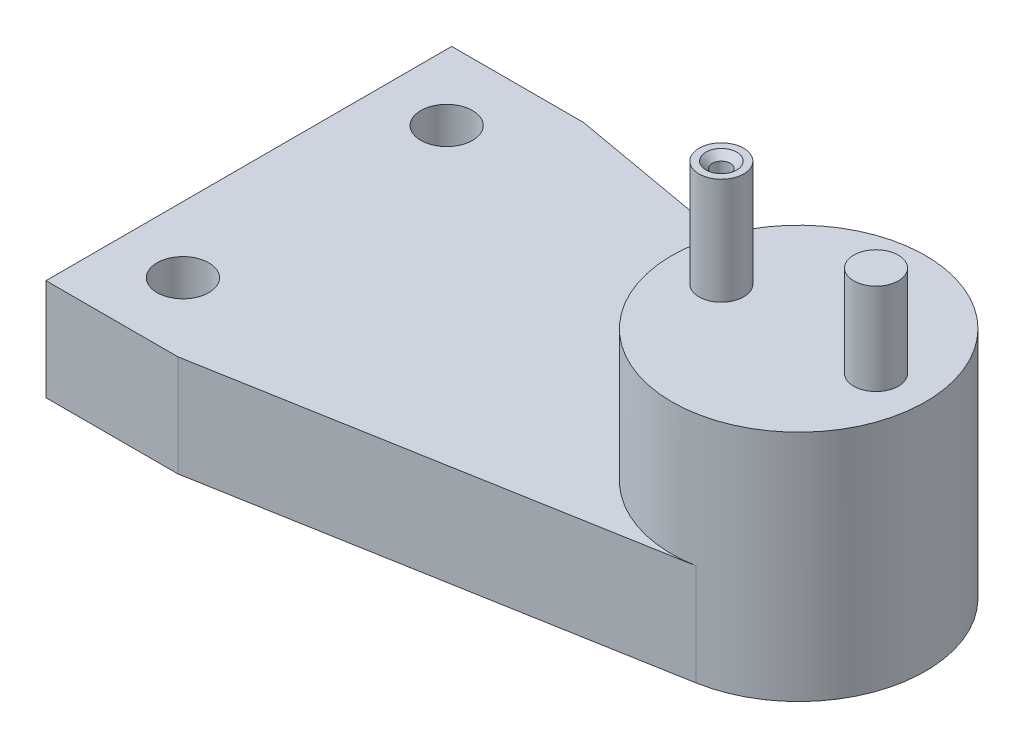
ISO-10303-21;
HEADER;
FILE_DESCRIPTION(('STEP AP214'),'2;1');
FILE_NAME('part.step','',(''),(''),'','','');
FILE_SCHEMA(('AUTOMOTIVE_DESIGN { 1 0 10303 214 1 1 1 1 }'));
ENDSEC;
DATA;
#1=APPLICATION_CONTEXT('core data for automotive mechanical design processes');
#2=APPLICATION_PROTOCOL_DEFINITION('international standard','automotive_design',2000,#1);
#3=PRODUCT_CONTEXT('',#1,'mechanical');
#4=PRODUCT('Part','Part','',(#3));
#5=PRODUCT_RELATED_PRODUCT_CATEGORY('part','',(#4));
#6=PRODUCT_DEFINITION_FORMATION('','',#4);
#7=PRODUCT_DEFINITION_CONTEXT('part definition',#1,'design');
#8=PRODUCT_DEFINITION('design','',#6,#7);
#9=PRODUCT_DEFINITION_SHAPE('','',#8);
#10=(LENGTH_UNIT() NAMED_UNIT(*) SI_UNIT(.MILLI.,.METRE.));
#11=(NAMED_UNIT(*) PLANE_ANGLE_UNIT() SI_UNIT($,.RADIAN.));
#12=(NAMED_UNIT(*) SI_UNIT($,.STERADIAN.) SOLID_ANGLE_UNIT());
#13=UNCERTAINTY_MEASURE_WITH_UNIT(LENGTH_MEASURE(1.E-05),#10,'distance_accuracy_value','');
#14=(GEOMETRIC_REPRESENTATION_CONTEXT(3) GLOBAL_UNCERTAINTY_ASSIGNED_CONTEXT((#13)) GLOBAL_UNIT_ASSIGNED_CONTEXT((#10,
#11,#12)) REPRESENTATION_CONTEXT('',''));
#15=CARTESIAN_POINT('',(0.,0.,0.));
#16=DIRECTION('',(0.,0.,1.));
#17=DIRECTION('',(1.,0.,0.));
#18=AXIS2_PLACEMENT_3D('',#15,#16,#17);
#19=CARTESIAN_POINT('',(54.205,23.,0.));
#20=DIRECTION('',(0.,1.,0.));
#21=DIRECTION('',(0.,0.,1.));
#22=AXIS2_PLACEMENT_3D('',#19,#20,#21);
#23=PLANE('',#22);
#24=CARTESIAN_POINT('',(61.83,23.,0.));
#25=DIRECTION('',(0.,1.,0.));
#26=DIRECTION('',(0.,0.,1.));
#27=AXIS2_PLACEMENT_3D('',#24,#25,#26);
#28=CIRCLE('',#27,2.2);
#29=CARTESIAN_POINT('',(61.83,23.,2.2));
#30=VERTEX_POINT('',#29);
#31=EDGE_CURVE('E132',#30,#30,#28,.T.);
#32=ORIENTED_EDGE('',*,*,#31,.F.);
#33=EDGE_LOOP('',(#32));
#34=FACE_BOUND('',#33,.T.);
#35=CARTESIAN_POINT('',(54.205,23.,0.));
#36=DIRECTION('',(0.,1.,0.));
#37=DIRECTION('',(0.,0.,1.));
#38=AXIS2_PLACEMENT_3D('',#35,#36,#37);
#39=CIRCLE('',#38,12.5);
#40=CARTESIAN_POINT('',(54.205,23.,12.5));
#41=VERTEX_POINT('',#40);
#42=EDGE_CURVE('E150',#41,#41,#39,.T.);
#43=ORIENTED_EDGE('',*,*,#42,.T.);
#44=EDGE_LOOP('',(#43));
#45=FACE_BOUND('',#44,.T.);
#46=CARTESIAN_POINT('',(46.58,23.,0.));
#47=DIRECTION('',(0.,1.,0.));
#48=DIRECTION('',(0.,0.,1.));
#49=AXIS2_PLACEMENT_3D('',#46,#47,#48);
#50=CIRCLE('',#49,2.2);
#51=CARTESIAN_POINT('',(46.58,23.,2.2));
#52=VERTEX_POINT('',#51);
#53=EDGE_CURVE('E123',#52,#52,#50,.T.);
#54=ORIENTED_EDGE('',*,*,#53,.F.);
#55=EDGE_LOOP('',(#54));
#56=FACE_BOUND('',#55,.T.);
#57=ADVANCED_FACE('F45',(#34,#45,#56),#23,.T.);
#58=CARTESIAN_POINT('',(54.205,10.,0.));
#59=DIRECTION('',(0.,-1.,0.));
#60=DIRECTION('',(0.,0.,-1.));
#61=AXIS2_PLACEMENT_3D('',#58,#59,#60);
#62=CYLINDRICAL_SURFACE('',#61,12.5);
#63=CARTESIAN_POINT('',(54.205,0.,0.));
#64=DIRECTION('',(0.,1.,0.));
#65=DIRECTION('',(0.,0.,1.));
#66=AXIS2_PLACEMENT_3D('',#63,#64,#65);
#67=CIRCLE('',#66,12.5);
#68=CARTESIAN_POINT('',(56.3870519478952,0.,12.3080725256511));
#69=VERTEX_POINT('',#68);
#70=CARTESIAN_POINT('',(56.3870519478952,0.,-12.3080725256511));
#71=VERTEX_POINT('',#70);
#72=EDGE_CURVE('E175',#69,#71,#67,.T.);
#73=ORIENTED_EDGE('',*,*,#72,.T.);
#74=DIRECTION('',(0.,-1.,0.));
#75=VECTOR('',#74,1.);
#76=CARTESIAN_POINT('',(56.3870519478952,10.,-12.3080725256511));
#77=LINE('',#76,#75);
#78=CARTESIAN_POINT('',(56.3870519478952,10.,-12.3080725256511));
#79=VERTEX_POINT('',#78);
#80=EDGE_CURVE('E55',#79,#71,#77,.T.);
#81=ORIENTED_EDGE('',*,*,#80,.F.);
#82=CARTESIAN_POINT('',(54.205,10.,0.));
#83=DIRECTION('',(0.,1.,0.));
#84=DIRECTION('',(0.,0.,1.));
#85=AXIS2_PLACEMENT_3D('',#82,#83,#84);
#86=CIRCLE('',#85,12.5);
#87=CARTESIAN_POINT('',(56.3870519478952,10.,12.3080725256511));
#88=VERTEX_POINT('',#87);
#89=EDGE_CURVE('E11',#79,#88,#86,.T.);
#90=ORIENTED_EDGE('',*,*,#89,.T.);
#91=DIRECTION('',(0.,-1.,0.));
#92=VECTOR('',#91,1.);
#93=CARTESIAN_POINT('',(56.3870519478952,10.,12.3080725256511));
#94=LINE('',#93,#92);
#95=EDGE_CURVE('E169',#88,#69,#94,.T.);
#96=ORIENTED_EDGE('',*,*,#95,.T.);
#97=EDGE_LOOP('',(#73,#81,#90,#96));
#98=FACE_BOUND('',#97,.T.);
#99=ORIENTED_EDGE('',*,*,#42,.F.);
#100=EDGE_LOOP('',(#99));
#101=FACE_BOUND('',#100,.T.);
#102=ADVANCED_FACE('F47',(#98,#101),#62,.T.);
#103=CARTESIAN_POINT('',(13.,10.,-20.));
#104=DIRECTION('',(-0.174564155831615,0.,0.984645802052086));
#105=DIRECTION('',(0.984645802052086,0.,0.174564155831615));
#106=AXIS2_PLACEMENT_3D('',#103,#104,#105);
#107=PLANE('',#106);
#108=DIRECTION('',(-0.984645802052086,0.,-0.174564155831615));
#109=VECTOR('',#108,1.);
#110=CARTESIAN_POINT('',(13.,0.,-20.));
#111=LINE('',#110,#109);
#112=CARTESIAN_POINT('',(13.,0.,-20.));
#113=VERTEX_POINT('',#112);
#114=EDGE_CURVE('E79',#71,#113,#111,.T.);
#115=ORIENTED_EDGE('',*,*,#114,.T.);
#116=DIRECTION('',(0.,-1.,0.));
#117=VECTOR('',#116,1.);
#118=CARTESIAN_POINT('',(13.,10.,-20.));
#119=LINE('',#118,#117);
#120=CARTESIAN_POINT('',(13.,10.,-20.));
#121=VERTEX_POINT('',#120);
#122=EDGE_CURVE('E182',#121,#113,#119,.T.);
#123=ORIENTED_EDGE('',*,*,#122,.F.);
#124=DIRECTION('',(-0.984645802052086,0.,-0.174564155831615));
#125=VECTOR('',#124,1.);
#126=CARTESIAN_POINT('',(13.,10.,-20.));
#127=LINE('',#126,#125);
#128=EDGE_CURVE('E172',#79,#121,#127,.T.);
#129=ORIENTED_EDGE('',*,*,#128,.F.);
#130=ORIENTED_EDGE('',*,*,#80,.T.);
#131=EDGE_LOOP('',(#115,#123,#129,#130));
#132=FACE_BOUND('',#131,.T.);
#133=ADVANCED_FACE('F195',(#132),#107,.F.);
#134=CARTESIAN_POINT('',(0.,10.,-20.));
#135=DIRECTION('',(0.,0.,1.));
#136=DIRECTION('',(1.,0.,0.));
#137=AXIS2_PLACEMENT_3D('',#134,#135,#136);
#138=PLANE('',#137);
#139=DIRECTION('',(-1.,0.,0.));
#140=VECTOR('',#139,1.);
#141=CARTESIAN_POINT('',(0.,0.,-20.));
#142=LINE('',#141,#140);
#143=CARTESIAN_POINT('',(0.,0.,-20.));
#144=VERTEX_POINT('',#143);
#145=EDGE_CURVE('E84',#113,#144,#142,.T.);
#146=ORIENTED_EDGE('',*,*,#145,.T.);
#147=DIRECTION('',(0.,-1.,0.));
#148=VECTOR('',#147,1.);
#149=CARTESIAN_POINT('',(0.,10.,-20.));
#150=LINE('',#149,#148);
#151=CARTESIAN_POINT('',(0.,10.,-20.));
#152=VERTEX_POINT('',#151);
#153=EDGE_CURVE('E174',#152,#144,#150,.T.);
#154=ORIENTED_EDGE('',*,*,#153,.F.);
#155=DIRECTION('',(-1.,0.,0.));
#156=VECTOR('',#155,1.);
#157=CARTESIAN_POINT('',(0.,10.,-20.));
#158=LINE('',#157,#156);
#159=EDGE_CURVE('E64',#121,#152,#158,.T.);
#160=ORIENTED_EDGE('',*,*,#159,.F.);
#161=ORIENTED_EDGE('',*,*,#122,.T.);
#162=EDGE_LOOP('',(#146,#154,#160,#161));
#163=FACE_BOUND('',#162,.T.);
#164=ADVANCED_FACE('F196',(#163),#138,.F.);
#165=CARTESIAN_POINT('',(0.,10.,0.));
#166=DIRECTION('',(1.,0.,0.));
#167=DIRECTION('',(0.,0.,-1.));
#168=AXIS2_PLACEMENT_3D('',#165,#166,#167);
#169=PLANE('',#168);
#170=DIRECTION('',(0.,0.,1.));
#171=VECTOR('',#170,1.);
#172=CARTESIAN_POINT('',(0.,0.,0.));
#173=LINE('',#172,#171);
#174=CARTESIAN_POINT('',(0.,0.,20.));
#175=VERTEX_POINT('',#174);
#176=EDGE_CURVE('E179',#144,#175,#173,.T.);
#177=ORIENTED_EDGE('',*,*,#176,.T.);
#178=DIRECTION('',(0.,-1.,0.));
#179=VECTOR('',#178,1.);
#180=CARTESIAN_POINT('',(0.,10.,20.));
#181=LINE('',#180,#179);
#182=CARTESIAN_POINT('',(0.,10.,20.));
#183=VERTEX_POINT('',#182);
#184=EDGE_CURVE('E157',#183,#175,#181,.T.);
#185=ORIENTED_EDGE('',*,*,#184,.F.);
#186=DIRECTION('',(0.,0.,1.));
#187=VECTOR('',#186,1.);
#188=CARTESIAN_POINT('',(0.,10.,0.));
#189=LINE('',#188,#187);
#190=EDGE_CURVE('E171',#152,#183,#189,.T.);
#191=ORIENTED_EDGE('',*,*,#190,.F.);
#192=ORIENTED_EDGE('',*,*,#153,.T.);
#193=EDGE_LOOP('',(#177,#185,#191,#192));
#194=FACE_BOUND('',#193,.T.);
#195=ADVANCED_FACE('F201',(#194),#169,.F.);
#196=CARTESIAN_POINT('',(54.205,10.,0.));
#197=DIRECTION('',(0.,1.,0.));
#198=DIRECTION('',(0.,0.,1.));
#199=AXIS2_PLACEMENT_3D('',#196,#197,#198);
#200=PLANE('',#199);
#201=CARTESIAN_POINT('',(6.5,10.,-13.));
#202=DIRECTION('',(0.,1.,0.));
#203=DIRECTION('',(0.,0.,1.));
#204=AXIS2_PLACEMENT_3D('',#201,#202,#203);
#205=CIRCLE('',#204,2.55269999999999);
#206=CARTESIAN_POINT('',(6.5,10.,-10.4473));
#207=VERTEX_POINT('',#206);
#208=EDGE_CURVE('E136',#207,#207,#205,.T.);
#209=ORIENTED_EDGE('',*,*,#208,.F.);
#210=EDGE_LOOP('',(#209));
#211=FACE_BOUND('',#210,.T.);
#212=CARTESIAN_POINT('',(6.5,10.,13.));
#213=DIRECTION('',(0.,1.,0.));
#214=DIRECTION('',(0.,0.,1.));
#215=AXIS2_PLACEMENT_3D('',#212,#213,#214);
#216=CIRCLE('',#215,2.55269999999999);
#217=CARTESIAN_POINT('',(6.5,10.,15.5527));
#218=VERTEX_POINT('',#217);
#219=EDGE_CURVE('E144',#218,#218,#216,.T.);
#220=ORIENTED_EDGE('',*,*,#219,.F.);
#221=EDGE_LOOP('',(#220));
#222=FACE_BOUND('',#221,.T.);
#223=ORIENTED_EDGE('',*,*,#89,.F.);
#224=ORIENTED_EDGE('',*,*,#128,.T.);
#225=ORIENTED_EDGE('',*,*,#159,.T.);
#226=ORIENTED_EDGE('',*,*,#190,.T.);
#227=DIRECTION('',(-1.,0.,0.));
#228=VECTOR('',#227,1.);
#229=CARTESIAN_POINT('',(0.,10.,20.));
#230=LINE('',#229,#228);
#231=CARTESIAN_POINT('',(13.,10.,20.));
#232=VERTEX_POINT('',#231);
#233=EDGE_CURVE('E154',#232,#183,#230,.T.);
#234=ORIENTED_EDGE('',*,*,#233,.F.);
#235=DIRECTION('',(-0.984645802052086,0.,0.174564155831615));
#236=VECTOR('',#235,1.);
#237=CARTESIAN_POINT('',(13.,10.,20.));
#238=LINE('',#237,#236);
#239=EDGE_CURVE('E158',#88,#232,#238,.T.);
#240=ORIENTED_EDGE('',*,*,#239,.F.);
#241=EDGE_LOOP('',(#223,#224,#225,#226,#234,#240));
#242=FACE_BOUND('',#241,.T.);
#243=ADVANCED_FACE('F194',(#211,#222,#242),#200,.T.);
#244=CARTESIAN_POINT('',(54.205,0.,0.));
#245=DIRECTION('',(0.,1.,0.));
#246=DIRECTION('',(0.,0.,1.));
#247=AXIS2_PLACEMENT_3D('',#244,#245,#246);
#248=PLANE('',#247);
#249=CARTESIAN_POINT('',(6.5,0.,-13.));
#250=DIRECTION('',(0.,1.,0.));
#251=DIRECTION('',(0.,0.,1.));
#252=AXIS2_PLACEMENT_3D('',#249,#250,#251);
#253=CIRCLE('',#252,2.55269999999998);
#254=CARTESIAN_POINT('',(6.5,0.,-10.4473));
#255=VERTEX_POINT('',#254);
#256=EDGE_CURVE('E141',#255,#255,#253,.T.);
#257=ORIENTED_EDGE('',*,*,#256,.T.);
#258=EDGE_LOOP('',(#257));
#259=FACE_BOUND('',#258,.T.);
#260=CARTESIAN_POINT('',(6.5,0.,13.));
#261=DIRECTION('',(0.,1.,0.));
#262=DIRECTION('',(0.,0.,1.));
#263=AXIS2_PLACEMENT_3D('',#260,#261,#262);
#264=CIRCLE('',#263,2.55269999999998);
#265=CARTESIAN_POINT('',(6.5,0.,15.5527));
#266=VERTEX_POINT('',#265);
#267=EDGE_CURVE('E147',#266,#266,#264,.T.);
#268=ORIENTED_EDGE('',*,*,#267,.T.);
#269=EDGE_LOOP('',(#268));
#270=FACE_BOUND('',#269,.T.);
#271=ORIENTED_EDGE('',*,*,#72,.F.);
#272=DIRECTION('',(-0.984645802052086,0.,0.174564155831615));
#273=VECTOR('',#272,1.);
#274=CARTESIAN_POINT('',(13.,0.,20.));
#275=LINE('',#274,#273);
#276=CARTESIAN_POINT('',(13.,0.,20.));
#277=VERTEX_POINT('',#276);
#278=EDGE_CURVE('E153',#69,#277,#275,.T.);
#279=ORIENTED_EDGE('',*,*,#278,.T.);
#280=DIRECTION('',(-1.,0.,0.));
#281=VECTOR('',#280,1.);
#282=CARTESIAN_POINT('',(0.,0.,20.));
#283=LINE('',#282,#281);
#284=EDGE_CURVE('E161',#277,#175,#283,.T.);
#285=ORIENTED_EDGE('',*,*,#284,.T.);
#286=ORIENTED_EDGE('',*,*,#176,.F.);
#287=ORIENTED_EDGE('',*,*,#145,.F.);
#288=ORIENTED_EDGE('',*,*,#114,.F.);
#289=EDGE_LOOP('',(#271,#279,#285,#286,#287,#288));
#290=FACE_BOUND('',#289,.T.);
#291=ADVANCED_FACE('F214',(#259,#270,#290),#248,.F.);
#292=CARTESIAN_POINT('',(13.,10.,20.));
#293=DIRECTION('',(-0.174564155831615,0.,-0.984645802052086));
#294=DIRECTION('',(0.984645802052086,0.,-0.174564155831615));
#295=AXIS2_PLACEMENT_3D('',#292,#293,#294);
#296=PLANE('',#295);
#297=ORIENTED_EDGE('',*,*,#278,.F.);
#298=ORIENTED_EDGE('',*,*,#95,.F.);
#299=ORIENTED_EDGE('',*,*,#239,.T.);
#300=DIRECTION('',(0.,-1.,0.));
#301=VECTOR('',#300,1.);
#302=CARTESIAN_POINT('',(13.,10.,20.));
#303=LINE('',#302,#301);
#304=EDGE_CURVE('E166',#232,#277,#303,.T.);
#305=ORIENTED_EDGE('',*,*,#304,.T.);
#306=EDGE_LOOP('',(#297,#298,#299,#305));
#307=FACE_BOUND('',#306,.T.);
#308=ADVANCED_FACE('F208',(#307),#296,.F.);
#309=CARTESIAN_POINT('',(0.,10.,20.));
#310=DIRECTION('',(0.,0.,-1.));
#311=DIRECTION('',(1.,0.,0.));
#312=AXIS2_PLACEMENT_3D('',#309,#310,#311);
#313=PLANE('',#312);
#314=ORIENTED_EDGE('',*,*,#284,.F.);
#315=ORIENTED_EDGE('',*,*,#304,.F.);
#316=ORIENTED_EDGE('',*,*,#233,.T.);
#317=ORIENTED_EDGE('',*,*,#184,.T.);
#318=EDGE_LOOP('',(#314,#315,#316,#317));
#319=FACE_BOUND('',#318,.T.);
#320=ADVANCED_FACE('F205',(#319),#313,.F.);
#321=CARTESIAN_POINT('',(6.5,10.,13.));
#322=DIRECTION('',(0.,1.,0.));
#323=DIRECTION('',(0.,0.,1.));
#324=AXIS2_PLACEMENT_3D('',#321,#322,#323);
#325=CYLINDRICAL_SURFACE('',#324,2.55269999999998);
#326=ORIENTED_EDGE('',*,*,#219,.T.);
#327=EDGE_LOOP('',(#326));
#328=FACE_BOUND('',#327,.T.);
#329=ORIENTED_EDGE('',*,*,#267,.F.);
#330=EDGE_LOOP('',(#329));
#331=FACE_BOUND('',#330,.T.);
#332=ADVANCED_FACE('F237',(#328,#331),#325,.F.);
#333=CARTESIAN_POINT('',(6.5,10.,-13.));
#334=DIRECTION('',(0.,1.,0.));
#335=DIRECTION('',(0.,0.,1.));
#336=AXIS2_PLACEMENT_3D('',#333,#334,#335);
#337=CYLINDRICAL_SURFACE('',#336,2.55269999999998);
#338=ORIENTED_EDGE('',*,*,#208,.T.);
#339=EDGE_LOOP('',(#338));
#340=FACE_BOUND('',#339,.T.);
#341=ORIENTED_EDGE('',*,*,#256,.F.);
#342=EDGE_LOOP('',(#341));
#343=FACE_BOUND('',#342,.T.);
#344=ADVANCED_FACE('F243',(#340,#343),#337,.F.);
#345=CARTESIAN_POINT('',(61.83,32.,0.));
#346=DIRECTION('',(0.,-1.,0.));
#347=DIRECTION('',(0.,0.,-1.));
#348=AXIS2_PLACEMENT_3D('',#345,#346,#347);
#349=CYLINDRICAL_SURFACE('',#348,2.2);
#350=CARTESIAN_POINT('',(61.83,32.,0.));
#351=DIRECTION('',(0.,1.,0.));
#352=DIRECTION('',(0.,0.,1.));
#353=AXIS2_PLACEMENT_3D('',#350,#351,#352);
#354=CIRCLE('',#353,2.2);
#355=CARTESIAN_POINT('',(61.83,32.,2.2));
#356=VERTEX_POINT('',#355);
#357=EDGE_CURVE('E133',#356,#356,#354,.T.);
#358=ORIENTED_EDGE('',*,*,#357,.F.);
#359=EDGE_LOOP('',(#358));
#360=FACE_BOUND('',#359,.T.);
#361=ORIENTED_EDGE('',*,*,#31,.T.);
#362=EDGE_LOOP('',(#361));
#363=FACE_BOUND('',#362,.T.);
#364=ADVANCED_FACE('F248',(#360,#363),#349,.T.);
#365=CARTESIAN_POINT('',(61.83,32.,0.));
#366=DIRECTION('',(0.,1.,0.));
#367=DIRECTION('',(0.,0.,1.));
#368=AXIS2_PLACEMENT_3D('',#365,#366,#367);
#369=PLANE('',#368);
#370=ORIENTED_EDGE('',*,*,#357,.T.);
#371=EDGE_LOOP('',(#370));
#372=FACE_BOUND('',#371,.T.);
#373=ADVANCED_FACE('F257',(#372),#369,.T.);
#374=CARTESIAN_POINT('',(46.58,32.,0.));
#375=DIRECTION('',(0.,-1.,0.));
#376=DIRECTION('',(0.,0.,-1.));
#377=AXIS2_PLACEMENT_3D('',#374,#375,#376);
#378=CYLINDRICAL_SURFACE('',#377,2.2);
#379=ORIENTED_EDGE('',*,*,#53,.T.);
#380=EDGE_LOOP('',(#379));
#381=FACE_BOUND('',#380,.T.);
#382=CARTESIAN_POINT('',(46.58,33.5,0.));
#383=DIRECTION('',(0.,1.,0.));
#384=DIRECTION('',(0.,0.,1.));
#385=AXIS2_PLACEMENT_3D('',#382,#383,#384);
#386=CIRCLE('',#385,2.2);
#387=CARTESIAN_POINT('',(46.58,33.5,2.2));
#388=VERTEX_POINT('',#387);
#389=EDGE_CURVE('E119',#388,#388,#386,.T.);
#390=ORIENTED_EDGE('',*,*,#389,.F.);
#391=EDGE_LOOP('',(#390));
#392=FACE_BOUND('',#391,.T.);
#393=ADVANCED_FACE('F264',(#381,#392),#378,.T.);
#394=CARTESIAN_POINT('',(46.58,33.5,0.));
#395=DIRECTION('',(0.,1.,0.));
#396=DIRECTION('',(0.,0.,1.));
#397=AXIS2_PLACEMENT_3D('',#394,#395,#396);
#398=PLANE('',#397);
#399=CARTESIAN_POINT('',(46.58,33.5,0.));
#400=DIRECTION('',(0.,1.,0.));
#401=DIRECTION('',(0.,0.,1.));
#402=AXIS2_PLACEMENT_3D('',#399,#400,#401);
#403=CIRCLE('',#402,1.524);
#404=CARTESIAN_POINT('',(46.58,33.5,1.524));
#405=VERTEX_POINT('',#404);
#406=EDGE_CURVE('E126',#405,#405,#403,.T.);
#407=ORIENTED_EDGE('',*,*,#406,.F.);
#408=EDGE_LOOP('',(#407));
#409=FACE_BOUND('',#408,.T.);
#410=ORIENTED_EDGE('',*,*,#389,.T.);
#411=EDGE_LOOP('',(#410));
#412=FACE_BOUND('',#411,.T.);
#413=ADVANCED_FACE('F113',(#409,#412),#398,.T.);
#414=CARTESIAN_POINT('',(46.58,26.86,0.));
#415=DIRECTION('',(0.,1.,0.));
#416=DIRECTION('',(0.,0.,1.));
#417=AXIS2_PLACEMENT_3D('',#414,#415,#416);
#418=CONICAL_SURFACE('',#417,0.888999999999987,1.02974425867664);
#419=CARTESIAN_POINT('',(46.58,26.3258349096845,0.));
#420=VERTEX_POINT('',#419);
#421=VERTEX_LOOP('',#420);
#422=FACE_BOUND('',#421,.T.);
#423=CARTESIAN_POINT('',(46.58,26.86,0.));
#424=DIRECTION('',(0.,1.,0.));
#425=DIRECTION('',(0.,0.,1.));
#426=AXIS2_PLACEMENT_3D('',#423,#424,#425);
#427=CIRCLE('',#426,0.888999999999987);
#428=CARTESIAN_POINT('',(46.58,26.86,0.888999999999987));
#429=VERTEX_POINT('',#428);
#430=EDGE_CURVE('E117',#429,#429,#427,.T.);
#431=ORIENTED_EDGE('',*,*,#430,.T.);
#432=EDGE_LOOP('',(#431));
#433=FACE_BOUND('',#432,.T.);
#434=ADVANCED_FACE('F109',(#422,#433),#418,.F.);
#435=CARTESIAN_POINT('',(46.58,33.5,0.));
#436=DIRECTION('',(0.,1.,0.));
#437=DIRECTION('',(0.,0.,1.));
#438=AXIS2_PLACEMENT_3D('',#435,#436,#437);
#439=CYLINDRICAL_SURFACE('',#438,0.888999999999994);
#440=ORIENTED_EDGE('',*,*,#430,.F.);
#441=EDGE_LOOP('',(#440));
#442=FACE_BOUND('',#441,.T.);
#443=CARTESIAN_POINT('',(46.58,32.865,0.));
#444=DIRECTION('',(0.,1.,0.));
#445=DIRECTION('',(0.,0.,1.));
#446=AXIS2_PLACEMENT_3D('',#443,#444,#445);
#447=CIRCLE('',#446,0.889000000000001);
#448=CARTESIAN_POINT('',(46.58,32.865,0.889000000000001));
#449=VERTEX_POINT('',#448);
#450=EDGE_CURVE('E120',#449,#449,#447,.T.);
#451=ORIENTED_EDGE('',*,*,#450,.T.);
#452=EDGE_LOOP('',(#451));
#453=FACE_BOUND('',#452,.T.);
#454=ADVANCED_FACE('F112',(#442,#453),#439,.F.);
#455=CARTESIAN_POINT('',(46.58,33.5,0.));
#456=DIRECTION('',(0.,1.,0.));
#457=DIRECTION('',(0.,0.,1.));
#458=AXIS2_PLACEMENT_3D('',#455,#456,#457);
#459=CONICAL_SURFACE('',#458,1.524,0.785398163397448);
#460=ORIENTED_EDGE('',*,*,#450,.F.);
#461=EDGE_LOOP('',(#460));
#462=FACE_BOUND('',#461,.T.);
#463=ORIENTED_EDGE('',*,*,#406,.T.);
#464=EDGE_LOOP('',(#463));
#465=FACE_BOUND('',#464,.T.);
#466=ADVANCED_FACE('F274',(#462,#465),#459,.F.);
#467=CLOSED_SHELL('',(#57,#102,#133,#164,#195,#243,#291,#308,#320,#332,#344,#364,#373,#393,#413,
#434,#454,#466));
#468=MANIFOLD_SOLID_BREP('B2',#467);
#469=ADVANCED_BREP_SHAPE_REPRESENTATION('',(#18,#468),#14);
#470=SHAPE_DEFINITION_REPRESENTATION(#9,#469);
ENDSEC;
END-ISO-10303-21;
